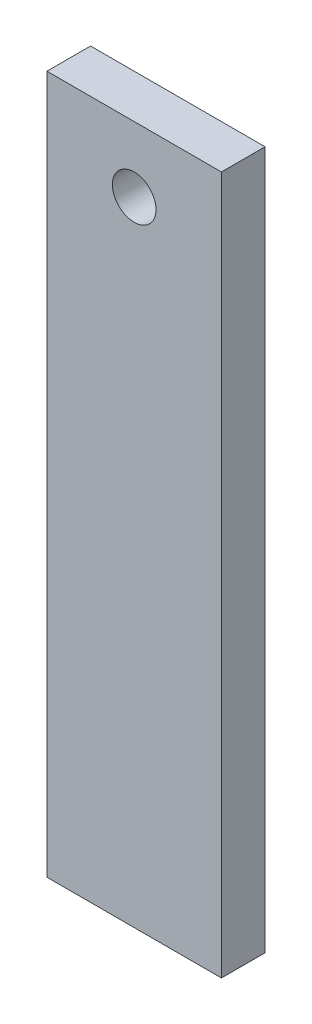
ISO-10303-21;
HEADER;
FILE_DESCRIPTION(('STEP AP214'),'2;1');
FILE_NAME('part.step','',(''),(''),'','','');
FILE_SCHEMA(('AUTOMOTIVE_DESIGN { 1 0 10303 214 1 1 1 1 }'));
ENDSEC;
DATA;
#1=APPLICATION_CONTEXT('core data for automotive mechanical design processes');
#2=APPLICATION_PROTOCOL_DEFINITION('international standard','automotive_design',2000,#1);
#3=PRODUCT_CONTEXT('',#1,'mechanical');
#4=PRODUCT('Part','Part','',(#3));
#5=PRODUCT_RELATED_PRODUCT_CATEGORY('part','',(#4));
#6=PRODUCT_DEFINITION_FORMATION('','',#4);
#7=PRODUCT_DEFINITION_CONTEXT('part definition',#1,'design');
#8=PRODUCT_DEFINITION('design','',#6,#7);
#9=PRODUCT_DEFINITION_SHAPE('','',#8);
#10=(LENGTH_UNIT() NAMED_UNIT(*) SI_UNIT(.MILLI.,.METRE.));
#11=(NAMED_UNIT(*) PLANE_ANGLE_UNIT() SI_UNIT($,.RADIAN.));
#12=(NAMED_UNIT(*) SI_UNIT($,.STERADIAN.) SOLID_ANGLE_UNIT());
#13=UNCERTAINTY_MEASURE_WITH_UNIT(LENGTH_MEASURE(1.E-05),#10,'distance_accuracy_value','');
#14=(GEOMETRIC_REPRESENTATION_CONTEXT(3) GLOBAL_UNCERTAINTY_ASSIGNED_CONTEXT((#13)) GLOBAL_UNIT_ASSIGNED_CONTEXT((#10,
#11,#12)) REPRESENTATION_CONTEXT('',''));
#15=CARTESIAN_POINT('',(0.,0.,0.));
#16=DIRECTION('',(0.,0.,1.));
#17=DIRECTION('',(1.,0.,0.));
#18=AXIS2_PLACEMENT_3D('',#15,#16,#17);
#19=CARTESIAN_POINT('',(-25.4,0.,12.7));
#20=DIRECTION('',(1.,0.,0.));
#21=DIRECTION('',(0.,0.,-1.));
#22=AXIS2_PLACEMENT_3D('',#19,#20,#21);
#23=PLANE('',#22);
#24=DIRECTION('',(0.,-1.,0.));
#25=VECTOR('',#24,1.);
#26=CARTESIAN_POINT('',(-25.4,0.,0.));
#27=LINE('',#26,#25);
#28=CARTESIAN_POINT('',(-25.4,203.2,0.));
#29=VERTEX_POINT('',#28);
#30=CARTESIAN_POINT('',(-25.4,0.,0.));
#31=VERTEX_POINT('',#30);
#32=EDGE_CURVE('E112',#29,#31,#27,.T.);
#33=ORIENTED_EDGE('',*,*,#32,.T.);
#34=DIRECTION('',(0.,0.,-1.));
#35=VECTOR('',#34,1.);
#36=CARTESIAN_POINT('',(-25.4,0.,12.7));
#37=LINE('',#36,#35);
#38=CARTESIAN_POINT('',(-25.4,0.,12.7));
#39=VERTEX_POINT('',#38);
#40=EDGE_CURVE('E11',#39,#31,#37,.T.);
#41=ORIENTED_EDGE('',*,*,#40,.F.);
#42=DIRECTION('',(0.,-1.,0.));
#43=VECTOR('',#42,1.);
#44=CARTESIAN_POINT('',(-25.4,0.,12.7));
#45=LINE('',#44,#43);
#46=CARTESIAN_POINT('',(-25.4,203.2,12.7));
#47=VERTEX_POINT('',#46);
#48=EDGE_CURVE('E113',#47,#39,#45,.T.);
#49=ORIENTED_EDGE('',*,*,#48,.F.);
#50=DIRECTION('',(0.,0.,-1.));
#51=VECTOR('',#50,1.);
#52=CARTESIAN_POINT('',(-25.4,203.2,12.7));
#53=LINE('',#52,#51);
#54=EDGE_CURVE('E119',#47,#29,#53,.T.);
#55=ORIENTED_EDGE('',*,*,#54,.T.);
#56=EDGE_LOOP('',(#33,#41,#49,#55));
#57=FACE_BOUND('',#56,.T.);
#58=ADVANCED_FACE('F35',(#57),#23,.F.);
#59=CARTESIAN_POINT('',(-25.4,0.,12.7));
#60=DIRECTION('',(0.,1.,0.));
#61=DIRECTION('',(0.,0.,1.));
#62=AXIS2_PLACEMENT_3D('',#59,#60,#61);
#63=PLANE('',#62);
#64=CARTESIAN_POINT('',(-15.875,0.,6.35));
#65=DIRECTION('',(0.,-1.,0.));
#66=DIRECTION('',(0.,0.,-1.));
#67=AXIS2_PLACEMENT_3D('',#64,#65,#66);
#68=CIRCLE('',#67,2.5527);
#69=CARTESIAN_POINT('',(-15.875,0.,3.7973));
#70=VERTEX_POINT('',#69);
#71=EDGE_CURVE('E100',#70,#70,#68,.T.);
#72=ORIENTED_EDGE('',*,*,#71,.F.);
#73=EDGE_LOOP('',(#72));
#74=FACE_BOUND('',#73,.T.);
#75=CARTESIAN_POINT('',(15.875,0.,6.35));
#76=DIRECTION('',(0.,-1.,0.));
#77=DIRECTION('',(0.,0.,-1.));
#78=AXIS2_PLACEMENT_3D('',#75,#76,#77);
#79=CIRCLE('',#78,2.5527);
#80=CARTESIAN_POINT('',(15.875,0.,3.7973));
#81=VERTEX_POINT('',#80);
#82=EDGE_CURVE('E99',#81,#81,#79,.T.);
#83=ORIENTED_EDGE('',*,*,#82,.F.);
#84=EDGE_LOOP('',(#83));
#85=FACE_BOUND('',#84,.T.);
#86=DIRECTION('',(1.,0.,0.));
#87=VECTOR('',#86,1.);
#88=CARTESIAN_POINT('',(-25.4,0.,0.));
#89=LINE('',#88,#87);
#90=CARTESIAN_POINT('',(25.4,0.,0.));
#91=VERTEX_POINT('',#90);
#92=EDGE_CURVE('E122',#31,#91,#89,.T.);
#93=ORIENTED_EDGE('',*,*,#92,.T.);
#94=DIRECTION('',(0.,0.,-1.));
#95=VECTOR('',#94,1.);
#96=CARTESIAN_POINT('',(25.4,0.,12.7));
#97=LINE('',#96,#95);
#98=CARTESIAN_POINT('',(25.4,0.,12.7));
#99=VERTEX_POINT('',#98);
#100=EDGE_CURVE('E43',#99,#91,#97,.T.);
#101=ORIENTED_EDGE('',*,*,#100,.F.);
#102=DIRECTION('',(1.,0.,0.));
#103=VECTOR('',#102,1.);
#104=CARTESIAN_POINT('',(-25.4,0.,12.7));
#105=LINE('',#104,#103);
#106=EDGE_CURVE('E82',#39,#99,#105,.T.);
#107=ORIENTED_EDGE('',*,*,#106,.F.);
#108=ORIENTED_EDGE('',*,*,#40,.T.);
#109=EDGE_LOOP('',(#93,#101,#107,#108));
#110=FACE_BOUND('',#109,.T.);
#111=ADVANCED_FACE('F147',(#74,#85,#110),#63,.F.);
#112=CARTESIAN_POINT('',(25.4,0.,12.7));
#113=DIRECTION('',(-1.,0.,0.));
#114=DIRECTION('',(0.,0.,1.));
#115=AXIS2_PLACEMENT_3D('',#112,#113,#114);
#116=PLANE('',#115);
#117=DIRECTION('',(0.,1.,0.));
#118=VECTOR('',#117,1.);
#119=CARTESIAN_POINT('',(25.4,0.,0.));
#120=LINE('',#119,#118);
#121=CARTESIAN_POINT('',(25.4,203.2,0.));
#122=VERTEX_POINT('',#121);
#123=EDGE_CURVE('E69',#91,#122,#120,.T.);
#124=ORIENTED_EDGE('',*,*,#123,.T.);
#125=DIRECTION('',(0.,0.,-1.));
#126=VECTOR('',#125,1.);
#127=CARTESIAN_POINT('',(25.4,203.2,12.7));
#128=LINE('',#127,#126);
#129=CARTESIAN_POINT('',(25.4,203.2,12.7));
#130=VERTEX_POINT('',#129);
#131=EDGE_CURVE('E127',#130,#122,#128,.T.);
#132=ORIENTED_EDGE('',*,*,#131,.F.);
#133=DIRECTION('',(0.,1.,0.));
#134=VECTOR('',#133,1.);
#135=CARTESIAN_POINT('',(25.4,0.,12.7));
#136=LINE('',#135,#134);
#137=EDGE_CURVE('E116',#99,#130,#136,.T.);
#138=ORIENTED_EDGE('',*,*,#137,.F.);
#139=ORIENTED_EDGE('',*,*,#100,.T.);
#140=EDGE_LOOP('',(#124,#132,#138,#139));
#141=FACE_BOUND('',#140,.T.);
#142=ADVANCED_FACE('F129',(#141),#116,.F.);
#143=CARTESIAN_POINT('',(-25.4,203.2,12.7));
#144=DIRECTION('',(0.,-1.,0.));
#145=DIRECTION('',(0.,0.,-1.));
#146=AXIS2_PLACEMENT_3D('',#143,#144,#145);
#147=PLANE('',#146);
#148=DIRECTION('',(-1.,0.,0.));
#149=VECTOR('',#148,1.);
#150=CARTESIAN_POINT('',(-25.4,203.2,0.));
#151=LINE('',#150,#149);
#152=EDGE_CURVE('E75',#122,#29,#151,.T.);
#153=ORIENTED_EDGE('',*,*,#152,.T.);
#154=ORIENTED_EDGE('',*,*,#54,.F.);
#155=DIRECTION('',(-1.,0.,0.));
#156=VECTOR('',#155,1.);
#157=CARTESIAN_POINT('',(-25.4,203.2,12.7));
#158=LINE('',#157,#156);
#159=EDGE_CURVE('E51',#130,#47,#158,.T.);
#160=ORIENTED_EDGE('',*,*,#159,.F.);
#161=ORIENTED_EDGE('',*,*,#131,.T.);
#162=EDGE_LOOP('',(#153,#154,#160,#161));
#163=FACE_BOUND('',#162,.T.);
#164=ADVANCED_FACE('F136',(#163),#147,.F.);
#165=CARTESIAN_POINT('',(0.,0.,12.7));
#166=DIRECTION('',(0.,0.,-1.));
#167=DIRECTION('',(-1.,0.,0.));
#168=AXIS2_PLACEMENT_3D('',#165,#166,#167);
#169=PLANE('',#168);
#170=CARTESIAN_POINT('',(0.,184.15,12.7));
#171=DIRECTION('',(0.,0.,-1.));
#172=DIRECTION('',(-1.,0.,0.));
#173=AXIS2_PLACEMENT_3D('',#170,#171,#172);
#174=CIRCLE('',#173,6.35);
#175=CARTESIAN_POINT('',(-6.35,184.15,12.7));
#176=VERTEX_POINT('',#175);
#177=EDGE_CURVE('E106',#176,#176,#174,.T.);
#178=ORIENTED_EDGE('',*,*,#177,.T.);
#179=EDGE_LOOP('',(#178));
#180=FACE_BOUND('',#179,.T.);
#181=ORIENTED_EDGE('',*,*,#48,.T.);
#182=ORIENTED_EDGE('',*,*,#106,.T.);
#183=ORIENTED_EDGE('',*,*,#137,.T.);
#184=ORIENTED_EDGE('',*,*,#159,.T.);
#185=EDGE_LOOP('',(#181,#182,#183,#184));
#186=FACE_BOUND('',#185,.T.);
#187=ADVANCED_FACE('F138',(#180,#186),#169,.F.);
#188=CARTESIAN_POINT('',(0.,0.,0.));
#189=DIRECTION('',(0.,0.,-1.));
#190=DIRECTION('',(-1.,0.,0.));
#191=AXIS2_PLACEMENT_3D('',#188,#189,#190);
#192=PLANE('',#191);
#193=CARTESIAN_POINT('',(0.,184.15,0.));
#194=DIRECTION('',(0.,0.,-1.));
#195=DIRECTION('',(-1.,0.,0.));
#196=AXIS2_PLACEMENT_3D('',#193,#194,#195);
#197=CIRCLE('',#196,6.35);
#198=CARTESIAN_POINT('',(-6.35,184.15,0.));
#199=VERTEX_POINT('',#198);
#200=EDGE_CURVE('E180',#199,#199,#197,.T.);
#201=ORIENTED_EDGE('',*,*,#200,.F.);
#202=EDGE_LOOP('',(#201));
#203=FACE_BOUND('',#202,.T.);
#204=ORIENTED_EDGE('',*,*,#32,.F.);
#205=ORIENTED_EDGE('',*,*,#152,.F.);
#206=ORIENTED_EDGE('',*,*,#123,.F.);
#207=ORIENTED_EDGE('',*,*,#92,.F.);
#208=EDGE_LOOP('',(#204,#205,#206,#207));
#209=FACE_BOUND('',#208,.T.);
#210=ADVANCED_FACE('F132',(#203,#209),#192,.T.);
#211=CARTESIAN_POINT('',(15.875,25.4,6.35));
#212=DIRECTION('',(0.,-1.,0.));
#213=DIRECTION('',(0.,0.,-1.));
#214=AXIS2_PLACEMENT_3D('',#211,#212,#213);
#215=CONICAL_SURFACE('',#214,2.5527,1.02974425867665);
#216=CARTESIAN_POINT('',(15.875,26.9338169021917,6.35));
#217=VERTEX_POINT('',#216);
#218=VERTEX_LOOP('',#217);
#219=FACE_BOUND('',#218,.T.);
#220=CARTESIAN_POINT('',(15.875,25.4,6.35));
#221=DIRECTION('',(0.,-1.,0.));
#222=DIRECTION('',(0.,0.,-1.));
#223=AXIS2_PLACEMENT_3D('',#220,#221,#222);
#224=CIRCLE('',#223,2.5527);
#225=CARTESIAN_POINT('',(15.875,25.4,3.7973));
#226=VERTEX_POINT('',#225);
#227=EDGE_CURVE('E103',#226,#226,#224,.T.);
#228=ORIENTED_EDGE('',*,*,#227,.T.);
#229=EDGE_LOOP('',(#228));
#230=FACE_BOUND('',#229,.T.);
#231=ADVANCED_FACE('F163',(#219,#230),#215,.F.);
#232=CARTESIAN_POINT('',(15.875,0.,6.35));
#233=DIRECTION('',(0.,-1.,0.));
#234=DIRECTION('',(0.,0.,-1.));
#235=AXIS2_PLACEMENT_3D('',#232,#233,#234);
#236=CYLINDRICAL_SURFACE('',#235,2.5527);
#237=ORIENTED_EDGE('',*,*,#227,.F.);
#238=EDGE_LOOP('',(#237));
#239=FACE_BOUND('',#238,.T.);
#240=ORIENTED_EDGE('',*,*,#82,.T.);
#241=EDGE_LOOP('',(#240));
#242=FACE_BOUND('',#241,.T.);
#243=ADVANCED_FACE('F93',(#239,#242),#236,.F.);
#244=CARTESIAN_POINT('',(-15.875,25.4,6.35));
#245=DIRECTION('',(0.,-1.,0.));
#246=DIRECTION('',(0.,0.,-1.));
#247=AXIS2_PLACEMENT_3D('',#244,#245,#246);
#248=CONICAL_SURFACE('',#247,2.5527,1.02974425867665);
#249=CARTESIAN_POINT('',(-15.875,26.9338169021917,6.35));
#250=VERTEX_POINT('',#249);
#251=VERTEX_LOOP('',#250);
#252=FACE_BOUND('',#251,.T.);
#253=CARTESIAN_POINT('',(-15.875,25.4,6.35));
#254=DIRECTION('',(0.,-1.,0.));
#255=DIRECTION('',(0.,0.,-1.));
#256=AXIS2_PLACEMENT_3D('',#253,#254,#255);
#257=CIRCLE('',#256,2.5527);
#258=CARTESIAN_POINT('',(-15.875,25.4,3.7973));
#259=VERTEX_POINT('',#258);
#260=EDGE_CURVE('E97',#259,#259,#257,.T.);
#261=ORIENTED_EDGE('',*,*,#260,.T.);
#262=EDGE_LOOP('',(#261));
#263=FACE_BOUND('',#262,.T.);
#264=ADVANCED_FACE('F89',(#252,#263),#248,.F.);
#265=CARTESIAN_POINT('',(-15.875,0.,6.35));
#266=DIRECTION('',(0.,-1.,0.));
#267=DIRECTION('',(0.,0.,-1.));
#268=AXIS2_PLACEMENT_3D('',#265,#266,#267);
#269=CYLINDRICAL_SURFACE('',#268,2.5527);
#270=ORIENTED_EDGE('',*,*,#260,.F.);
#271=EDGE_LOOP('',(#270));
#272=FACE_BOUND('',#271,.T.);
#273=ORIENTED_EDGE('',*,*,#71,.T.);
#274=EDGE_LOOP('',(#273));
#275=FACE_BOUND('',#274,.T.);
#276=ADVANCED_FACE('F92',(#272,#275),#269,.F.);
#277=CARTESIAN_POINT('',(0.,184.15,12.7));
#278=DIRECTION('',(0.,0.,-1.));
#279=DIRECTION('',(-1.,0.,0.));
#280=AXIS2_PLACEMENT_3D('',#277,#278,#279);
#281=CYLINDRICAL_SURFACE('',#280,6.35);
#282=ORIENTED_EDGE('',*,*,#177,.F.);
#283=EDGE_LOOP('',(#282));
#284=FACE_BOUND('',#283,.T.);
#285=ORIENTED_EDGE('',*,*,#200,.T.);
#286=EDGE_LOOP('',(#285));
#287=FACE_BOUND('',#286,.T.);
#288=ADVANCED_FACE('F186',(#284,#287),#281,.F.);
#289=CLOSED_SHELL('',(#58,#111,#142,#164,#187,#210,#231,#243,#264,#276,#288));
#290=MANIFOLD_SOLID_BREP('B2',#289);
#291=ADVANCED_BREP_SHAPE_REPRESENTATION('',(#18,#290),#14);
#292=SHAPE_DEFINITION_REPRESENTATION(#9,#291);
ENDSEC;
END-ISO-10303-21;
